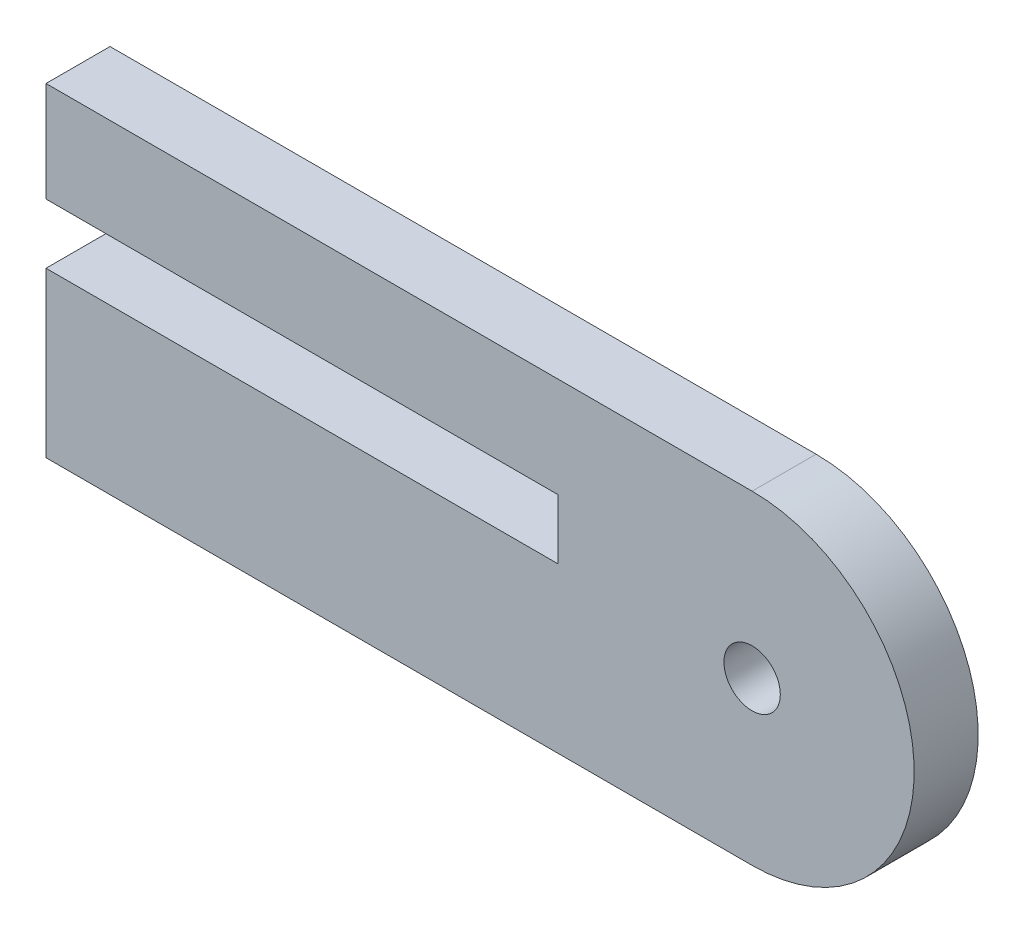
ISO-10303-21;
HEADER;
FILE_DESCRIPTION(('STEP AP214'),'2;1');
FILE_NAME('part.step','',(''),(''),'','','');
FILE_SCHEMA(('AUTOMOTIVE_DESIGN { 1 0 10303 214 1 1 1 1 }'));
ENDSEC;
DATA;
#1=APPLICATION_CONTEXT('core data for automotive mechanical design processes');
#2=APPLICATION_PROTOCOL_DEFINITION('international standard','automotive_design',2000,#1);
#3=PRODUCT_CONTEXT('',#1,'mechanical');
#4=PRODUCT('Part','Part','',(#3));
#5=PRODUCT_RELATED_PRODUCT_CATEGORY('part','',(#4));
#6=PRODUCT_DEFINITION_FORMATION('','',#4);
#7=PRODUCT_DEFINITION_CONTEXT('part definition',#1,'design');
#8=PRODUCT_DEFINITION('design','',#6,#7);
#9=PRODUCT_DEFINITION_SHAPE('','',#8);
#10=(LENGTH_UNIT() NAMED_UNIT(*) SI_UNIT(.MILLI.,.METRE.));
#11=(NAMED_UNIT(*) PLANE_ANGLE_UNIT() SI_UNIT($,.RADIAN.));
#12=(NAMED_UNIT(*) SI_UNIT($,.STERADIAN.) SOLID_ANGLE_UNIT());
#13=UNCERTAINTY_MEASURE_WITH_UNIT(LENGTH_MEASURE(1.E-05),#10,'distance_accuracy_value','');
#14=(GEOMETRIC_REPRESENTATION_CONTEXT(3) GLOBAL_UNCERTAINTY_ASSIGNED_CONTEXT((#13)) GLOBAL_UNIT_ASSIGNED_CONTEXT((#10,
#11,#12)) REPRESENTATION_CONTEXT('',''));
#15=CARTESIAN_POINT('',(0.,0.,0.));
#16=DIRECTION('',(0.,0.,1.));
#17=DIRECTION('',(1.,0.,0.));
#18=AXIS2_PLACEMENT_3D('',#15,#16,#17);
#19=CARTESIAN_POINT('',(34.925,7.9375,3.175));
#20=DIRECTION('',(0.,0.,1.));
#21=DIRECTION('',(1.,0.,0.));
#22=AXIS2_PLACEMENT_3D('',#19,#20,#21);
#23=PLANE('',#22);
#24=DIRECTION('',(0.,1.,0.));
#25=VECTOR('',#24,1.);
#26=CARTESIAN_POINT('',(-0.101600000000001,11.0109,3.175));
#27=LINE('',#26,#25);
#28=CARTESIAN_POINT('',(-0.101600000000001,11.0109,3.175));
#29=VERTEX_POINT('',#28);
#30=CARTESIAN_POINT('',(-0.101600000000001,15.9766,3.175));
#31=VERTEX_POINT('',#30);
#32=EDGE_CURVE('E188',#29,#31,#27,.T.);
#33=ORIENTED_EDGE('',*,*,#32,.F.);
#34=DIRECTION('',(1.,0.,0.));
#35=VECTOR('',#34,1.);
#36=CARTESIAN_POINT('',(-0.101600000000001,11.0109,3.175));
#37=LINE('',#36,#35);
#38=CARTESIAN_POINT('',(25.2984,11.0109,3.175));
#39=VERTEX_POINT('',#38);
#40=EDGE_CURVE('E144',#29,#39,#37,.T.);
#41=ORIENTED_EDGE('',*,*,#40,.T.);
#42=DIRECTION('',(0.,-1.,0.));
#43=VECTOR('',#42,1.);
#44=CARTESIAN_POINT('',(25.2984,11.0109,3.175));
#45=LINE('',#44,#43);
#46=CARTESIAN_POINT('',(25.2984,8.0391,3.175));
#47=VERTEX_POINT('',#46);
#48=EDGE_CURVE('E137',#39,#47,#45,.T.);
#49=ORIENTED_EDGE('',*,*,#48,.T.);
#50=DIRECTION('',(1.,0.,0.));
#51=VECTOR('',#50,1.);
#52=CARTESIAN_POINT('',(-0.101599999999999,8.0391,3.175));
#53=LINE('',#52,#51);
#54=CARTESIAN_POINT('',(-0.101599999999999,8.0391,3.175));
#55=VERTEX_POINT('',#54);
#56=EDGE_CURVE('E143',#55,#47,#53,.T.);
#57=ORIENTED_EDGE('',*,*,#56,.F.);
#58=DIRECTION('',(0.,1.,0.));
#59=VECTOR('',#58,1.);
#60=CARTESIAN_POINT('',(-0.1016,-0.1016,3.175));
#61=LINE('',#60,#59);
#62=CARTESIAN_POINT('',(-0.1016,-0.1016,3.175));
#63=VERTEX_POINT('',#62);
#64=EDGE_CURVE('E161',#63,#55,#61,.T.);
#65=ORIENTED_EDGE('',*,*,#64,.F.);
#66=DIRECTION('',(1.,0.,0.));
#67=VECTOR('',#66,1.);
#68=CARTESIAN_POINT('',(-0.1016,-0.1016,3.175));
#69=LINE('',#68,#67);
#70=CARTESIAN_POINT('',(34.925,-0.1016,3.175));
#71=VERTEX_POINT('',#70);
#72=EDGE_CURVE('E164',#63,#71,#69,.T.);
#73=ORIENTED_EDGE('',*,*,#72,.T.);
#74=CARTESIAN_POINT('',(34.925,7.9375,3.175));
#75=DIRECTION('',(0.,0.,1.));
#76=DIRECTION('',(1.,0.,0.));
#77=AXIS2_PLACEMENT_3D('',#74,#75,#76);
#78=CIRCLE('',#77,8.0391);
#79=CARTESIAN_POINT('',(34.925,15.9766,3.175));
#80=VERTEX_POINT('',#79);
#81=EDGE_CURVE('E180',#71,#80,#78,.T.);
#82=ORIENTED_EDGE('',*,*,#81,.T.);
#83=DIRECTION('',(1.,0.,0.));
#84=VECTOR('',#83,1.);
#85=CARTESIAN_POINT('',(-0.101600000000001,15.9766,3.175));
#86=LINE('',#85,#84);
#87=EDGE_CURVE('E184',#31,#80,#86,.T.);
#88=ORIENTED_EDGE('',*,*,#87,.F.);
#89=EDGE_LOOP('',(#33,#41,#49,#57,#65,#73,#82,#88));
#90=FACE_BOUND('',#89,.T.);
#91=CARTESIAN_POINT('',(34.925,7.9375,3.175));
#92=DIRECTION('',(0.,0.,1.));
#93=DIRECTION('',(1.,0.,0.));
#94=AXIS2_PLACEMENT_3D('',#91,#92,#93);
#95=CIRCLE('',#94,1.3984);
#96=CARTESIAN_POINT('',(36.3234,7.9375,3.175));
#97=VERTEX_POINT('',#96);
#98=EDGE_CURVE('E201',#97,#97,#95,.T.);
#99=ORIENTED_EDGE('',*,*,#98,.F.);
#100=EDGE_LOOP('',(#99));
#101=FACE_BOUND('',#100,.T.);
#102=ADVANCED_FACE('F66',(#90,#101),#23,.T.);
#103=CARTESIAN_POINT('',(34.925,7.9375,0.));
#104=DIRECTION('',(0.,0.,1.));
#105=DIRECTION('',(1.,0.,0.));
#106=AXIS2_PLACEMENT_3D('',#103,#104,#105);
#107=PLANE('',#106);
#108=DIRECTION('',(0.,1.,0.));
#109=VECTOR('',#108,1.);
#110=CARTESIAN_POINT('',(-0.101600000000001,11.0109,0.));
#111=LINE('',#110,#109);
#112=CARTESIAN_POINT('',(-0.101600000000001,11.0109,0.));
#113=VERTEX_POINT('',#112);
#114=CARTESIAN_POINT('',(-0.101600000000001,15.9766,0.));
#115=VERTEX_POINT('',#114);
#116=EDGE_CURVE('E197',#113,#115,#111,.T.);
#117=ORIENTED_EDGE('',*,*,#116,.T.);
#118=DIRECTION('',(1.,0.,0.));
#119=VECTOR('',#118,1.);
#120=CARTESIAN_POINT('',(-0.101600000000001,15.9766,0.));
#121=LINE('',#120,#119);
#122=CARTESIAN_POINT('',(34.925,15.9766,0.));
#123=VERTEX_POINT('',#122);
#124=EDGE_CURVE('E200',#115,#123,#121,.T.);
#125=ORIENTED_EDGE('',*,*,#124,.T.);
#126=CARTESIAN_POINT('',(34.925,7.9375,0.));
#127=DIRECTION('',(0.,0.,1.));
#128=DIRECTION('',(1.,0.,0.));
#129=AXIS2_PLACEMENT_3D('',#126,#127,#128);
#130=CIRCLE('',#129,8.0391);
#131=CARTESIAN_POINT('',(34.925,-0.1016,0.));
#132=VERTEX_POINT('',#131);
#133=EDGE_CURVE('E204',#132,#123,#130,.T.);
#134=ORIENTED_EDGE('',*,*,#133,.F.);
#135=DIRECTION('',(1.,0.,0.));
#136=VECTOR('',#135,1.);
#137=CARTESIAN_POINT('',(-0.1016,-0.1016,0.));
#138=LINE('',#137,#136);
#139=CARTESIAN_POINT('',(-0.1016,-0.1016,0.));
#140=VERTEX_POINT('',#139);
#141=EDGE_CURVE('E207',#140,#132,#138,.T.);
#142=ORIENTED_EDGE('',*,*,#141,.F.);
#143=DIRECTION('',(0.,1.,0.));
#144=VECTOR('',#143,1.);
#145=CARTESIAN_POINT('',(-0.1016,4.76250000000001,0.));
#146=LINE('',#145,#144);
#147=CARTESIAN_POINT('',(-0.101599999999999,8.0391,0.));
#148=VERTEX_POINT('',#147);
#149=EDGE_CURVE('E209',#140,#148,#146,.T.);
#150=ORIENTED_EDGE('',*,*,#149,.T.);
#151=DIRECTION('',(1.,0.,0.));
#152=VECTOR('',#151,1.);
#153=CARTESIAN_POINT('',(-0.101599999999999,8.0391,0.));
#154=LINE('',#153,#152);
#155=CARTESIAN_POINT('',(25.2984,8.0391,0.));
#156=VERTEX_POINT('',#155);
#157=EDGE_CURVE('E212',#148,#156,#154,.T.);
#158=ORIENTED_EDGE('',*,*,#157,.T.);
#159=DIRECTION('',(0.,-1.,0.));
#160=VECTOR('',#159,1.);
#161=CARTESIAN_POINT('',(25.2984,11.0109,0.));
#162=LINE('',#161,#160);
#163=CARTESIAN_POINT('',(25.2984,11.0109,0.));
#164=VERTEX_POINT('',#163);
#165=EDGE_CURVE('E152',#164,#156,#162,.T.);
#166=ORIENTED_EDGE('',*,*,#165,.F.);
#167=DIRECTION('',(1.,0.,0.));
#168=VECTOR('',#167,1.);
#169=CARTESIAN_POINT('',(-0.101600000000001,11.0109,0.));
#170=LINE('',#169,#168);
#171=EDGE_CURVE('E112',#113,#164,#170,.T.);
#172=ORIENTED_EDGE('',*,*,#171,.F.);
#173=EDGE_LOOP('',(#117,#125,#134,#142,#150,#158,#166,#172));
#174=FACE_BOUND('',#173,.T.);
#175=CARTESIAN_POINT('',(34.925,7.9375,0.));
#176=DIRECTION('',(0.,0.,1.));
#177=DIRECTION('',(1.,0.,0.));
#178=AXIS2_PLACEMENT_3D('',#175,#176,#177);
#179=CIRCLE('',#178,1.3984);
#180=CARTESIAN_POINT('',(36.3234,7.9375,0.));
#181=VERTEX_POINT('',#180);
#182=EDGE_CURVE('E192',#181,#181,#179,.T.);
#183=ORIENTED_EDGE('',*,*,#182,.T.);
#184=EDGE_LOOP('',(#183));
#185=FACE_BOUND('',#184,.T.);
#186=ADVANCED_FACE('F228',(#174,#185),#107,.F.);
#187=CARTESIAN_POINT('',(-0.101600000000001,11.0109,3.175));
#188=DIRECTION('',(-1.,0.,0.));
#189=DIRECTION('',(0.,0.,1.));
#190=AXIS2_PLACEMENT_3D('',#187,#188,#189);
#191=PLANE('',#190);
#192=ORIENTED_EDGE('',*,*,#116,.F.);
#193=DIRECTION('',(0.,0.,-1.));
#194=VECTOR('',#193,1.);
#195=CARTESIAN_POINT('',(-0.101600000000001,11.0109,3.175));
#196=LINE('',#195,#194);
#197=EDGE_CURVE('E13',#29,#113,#196,.T.);
#198=ORIENTED_EDGE('',*,*,#197,.F.);
#199=ORIENTED_EDGE('',*,*,#32,.T.);
#200=DIRECTION('',(0.,0.,-1.));
#201=VECTOR('',#200,1.);
#202=CARTESIAN_POINT('',(-0.101600000000001,15.9766,3.175));
#203=LINE('',#202,#201);
#204=EDGE_CURVE('E70',#31,#115,#203,.T.);
#205=ORIENTED_EDGE('',*,*,#204,.T.);
#206=EDGE_LOOP('',(#192,#198,#199,#205));
#207=FACE_BOUND('',#206,.T.);
#208=ADVANCED_FACE('F68',(#207),#191,.T.);
#209=CARTESIAN_POINT('',(-0.101600000000001,11.0109,3.175));
#210=DIRECTION('',(0.,1.,0.));
#211=DIRECTION('',(0.,0.,1.));
#212=AXIS2_PLACEMENT_3D('',#209,#210,#211);
#213=PLANE('',#212);
#214=ORIENTED_EDGE('',*,*,#171,.T.);
#215=DIRECTION('',(0.,0.,-1.));
#216=VECTOR('',#215,1.);
#217=CARTESIAN_POINT('',(25.2984,11.0109,3.175));
#218=LINE('',#217,#216);
#219=EDGE_CURVE('E76',#39,#164,#218,.T.);
#220=ORIENTED_EDGE('',*,*,#219,.F.);
#221=ORIENTED_EDGE('',*,*,#40,.F.);
#222=ORIENTED_EDGE('',*,*,#197,.T.);
#223=EDGE_LOOP('',(#214,#220,#221,#222));
#224=FACE_BOUND('',#223,.T.);
#225=ADVANCED_FACE('F256',(#224),#213,.F.);
#226=CARTESIAN_POINT('',(25.2984,11.0109,3.175));
#227=DIRECTION('',(1.,0.,0.));
#228=DIRECTION('',(0.,0.,-1.));
#229=AXIS2_PLACEMENT_3D('',#226,#227,#228);
#230=PLANE('',#229);
#231=ORIENTED_EDGE('',*,*,#165,.T.);
#232=DIRECTION('',(0.,0.,-1.));
#233=VECTOR('',#232,1.);
#234=CARTESIAN_POINT('',(25.2984,8.0391,3.175));
#235=LINE('',#234,#233);
#236=EDGE_CURVE('E149',#47,#156,#235,.T.);
#237=ORIENTED_EDGE('',*,*,#236,.F.);
#238=ORIENTED_EDGE('',*,*,#48,.F.);
#239=ORIENTED_EDGE('',*,*,#219,.T.);
#240=EDGE_LOOP('',(#231,#237,#238,#239));
#241=FACE_BOUND('',#240,.T.);
#242=ADVANCED_FACE('F150',(#241),#230,.F.);
#243=CARTESIAN_POINT('',(-0.101599999999999,8.0391,3.175));
#244=DIRECTION('',(0.,1.,0.));
#245=DIRECTION('',(0.,0.,1.));
#246=AXIS2_PLACEMENT_3D('',#243,#244,#245);
#247=PLANE('',#246);
#248=ORIENTED_EDGE('',*,*,#157,.F.);
#249=DIRECTION('',(0.,0.,-1.));
#250=VECTOR('',#249,1.);
#251=CARTESIAN_POINT('',(-0.101599999999999,8.0391,3.175));
#252=LINE('',#251,#250);
#253=EDGE_CURVE('E156',#55,#148,#252,.T.);
#254=ORIENTED_EDGE('',*,*,#253,.F.);
#255=ORIENTED_EDGE('',*,*,#56,.T.);
#256=ORIENTED_EDGE('',*,*,#236,.T.);
#257=EDGE_LOOP('',(#248,#254,#255,#256));
#258=FACE_BOUND('',#257,.T.);
#259=ADVANCED_FACE('F159',(#258),#247,.T.);
#260=CARTESIAN_POINT('',(-0.1016,4.76250000000001,3.175));
#261=DIRECTION('',(-1.,0.,0.));
#262=DIRECTION('',(0.,-1.,0.));
#263=AXIS2_PLACEMENT_3D('',#260,#261,#262);
#264=PLANE('',#263);
#265=ORIENTED_EDGE('',*,*,#149,.F.);
#266=DIRECTION('',(0.,0.,-1.));
#267=VECTOR('',#266,1.);
#268=CARTESIAN_POINT('',(-0.1016,-0.1016,3.175));
#269=LINE('',#268,#267);
#270=EDGE_CURVE('E218',#63,#140,#269,.T.);
#271=ORIENTED_EDGE('',*,*,#270,.F.);
#272=ORIENTED_EDGE('',*,*,#64,.T.);
#273=ORIENTED_EDGE('',*,*,#253,.T.);
#274=EDGE_LOOP('',(#265,#271,#272,#273));
#275=FACE_BOUND('',#274,.T.);
#276=ADVANCED_FACE('F232',(#275),#264,.T.);
#277=CARTESIAN_POINT('',(-0.1016,-0.1016,3.175));
#278=DIRECTION('',(0.,1.,0.));
#279=DIRECTION('',(-1.,0.,0.));
#280=AXIS2_PLACEMENT_3D('',#277,#278,#279);
#281=PLANE('',#280);
#282=ORIENTED_EDGE('',*,*,#141,.T.);
#283=DIRECTION('',(0.,0.,-1.));
#284=VECTOR('',#283,1.);
#285=CARTESIAN_POINT('',(34.925,-0.1016,3.175));
#286=LINE('',#285,#284);
#287=EDGE_CURVE('E221',#71,#132,#286,.T.);
#288=ORIENTED_EDGE('',*,*,#287,.F.);
#289=ORIENTED_EDGE('',*,*,#72,.F.);
#290=ORIENTED_EDGE('',*,*,#270,.T.);
#291=EDGE_LOOP('',(#282,#288,#289,#290));
#292=FACE_BOUND('',#291,.T.);
#293=ADVANCED_FACE('F235',(#292),#281,.F.);
#294=CARTESIAN_POINT('',(34.925,7.9375,3.175));
#295=DIRECTION('',(0.,0.,-1.));
#296=DIRECTION('',(-1.,0.,0.));
#297=AXIS2_PLACEMENT_3D('',#294,#295,#296);
#298=CYLINDRICAL_SURFACE('',#297,8.0391);
#299=ORIENTED_EDGE('',*,*,#133,.T.);
#300=DIRECTION('',(0.,0.,-1.));
#301=VECTOR('',#300,1.);
#302=CARTESIAN_POINT('',(34.925,15.9766,3.175));
#303=LINE('',#302,#301);
#304=EDGE_CURVE('E223',#80,#123,#303,.T.);
#305=ORIENTED_EDGE('',*,*,#304,.F.);
#306=ORIENTED_EDGE('',*,*,#81,.F.);
#307=ORIENTED_EDGE('',*,*,#287,.T.);
#308=EDGE_LOOP('',(#299,#305,#306,#307));
#309=FACE_BOUND('',#308,.T.);
#310=ADVANCED_FACE('F239',(#309),#298,.T.);
#311=CARTESIAN_POINT('',(-0.101600000000001,15.9766,3.175));
#312=DIRECTION('',(0.,1.,0.));
#313=DIRECTION('',(0.,0.,1.));
#314=AXIS2_PLACEMENT_3D('',#311,#312,#313);
#315=PLANE('',#314);
#316=ORIENTED_EDGE('',*,*,#124,.F.);
#317=ORIENTED_EDGE('',*,*,#204,.F.);
#318=ORIENTED_EDGE('',*,*,#87,.T.);
#319=ORIENTED_EDGE('',*,*,#304,.T.);
#320=EDGE_LOOP('',(#316,#317,#318,#319));
#321=FACE_BOUND('',#320,.T.);
#322=ADVANCED_FACE('F225',(#321),#315,.T.);
#323=CARTESIAN_POINT('',(34.925,7.9375,3.175));
#324=DIRECTION('',(0.,0.,-1.));
#325=DIRECTION('',(-1.,0.,0.));
#326=AXIS2_PLACEMENT_3D('',#323,#324,#325);
#327=CYLINDRICAL_SURFACE('',#326,1.3984);
#328=ORIENTED_EDGE('',*,*,#98,.T.);
#329=EDGE_LOOP('',(#328));
#330=FACE_BOUND('',#329,.T.);
#331=ORIENTED_EDGE('',*,*,#182,.F.);
#332=EDGE_LOOP('',(#331));
#333=FACE_BOUND('',#332,.T.);
#334=ADVANCED_FACE('F246',(#330,#333),#327,.F.);
#335=CLOSED_SHELL('',(#102,#186,#208,#225,#242,#259,#276,#293,#310,#322,#334));
#336=MANIFOLD_SOLID_BREP('B2',#335);
#337=ADVANCED_BREP_SHAPE_REPRESENTATION('',(#18,#336),#14);
#338=SHAPE_DEFINITION_REPRESENTATION(#9,#337);
ENDSEC;
END-ISO-10303-21;
